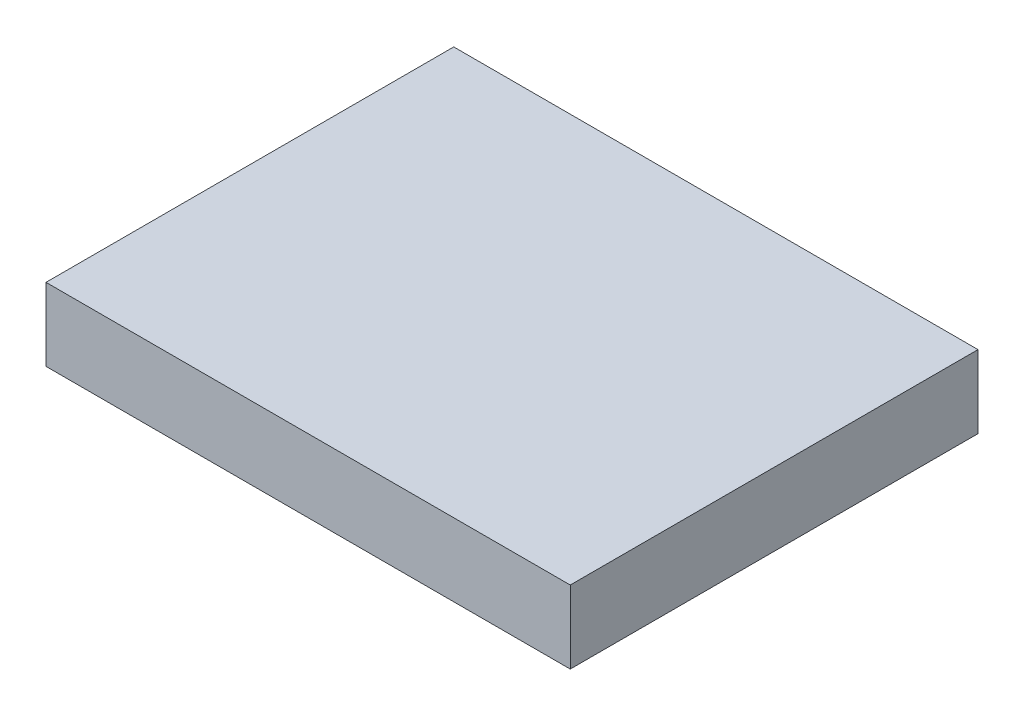
ISO-10303-21;
HEADER;
FILE_DESCRIPTION(('STEP AP214'),'2;1');
FILE_NAME('part.step','',(''),(''),'','','');
FILE_SCHEMA(('AUTOMOTIVE_DESIGN { 1 0 10303 214 1 1 1 1 }'));
ENDSEC;
DATA;
#1=APPLICATION_CONTEXT('core data for automotive mechanical design processes');
#2=APPLICATION_PROTOCOL_DEFINITION('international standard','automotive_design',2000,#1);
#3=PRODUCT_CONTEXT('',#1,'mechanical');
#4=PRODUCT('Part','Part','',(#3));
#5=PRODUCT_RELATED_PRODUCT_CATEGORY('part','',(#4));
#6=PRODUCT_DEFINITION_FORMATION('','',#4);
#7=PRODUCT_DEFINITION_CONTEXT('part definition',#1,'design');
#8=PRODUCT_DEFINITION('design','',#6,#7);
#9=PRODUCT_DEFINITION_SHAPE('','',#8);
#10=(LENGTH_UNIT() NAMED_UNIT(*) SI_UNIT(.MILLI.,.METRE.));
#11=(NAMED_UNIT(*) PLANE_ANGLE_UNIT() SI_UNIT($,.RADIAN.));
#12=(NAMED_UNIT(*) SI_UNIT($,.STERADIAN.) SOLID_ANGLE_UNIT());
#13=UNCERTAINTY_MEASURE_WITH_UNIT(LENGTH_MEASURE(1.E-05),#10,'distance_accuracy_value','');
#14=(GEOMETRIC_REPRESENTATION_CONTEXT(3) GLOBAL_UNCERTAINTY_ASSIGNED_CONTEXT((#13)) GLOBAL_UNIT_ASSIGNED_CONTEXT((#10,
#11,#12)) REPRESENTATION_CONTEXT('',''));
#15=CARTESIAN_POINT('',(0.,0.,0.));
#16=DIRECTION('',(0.,0.,1.));
#17=DIRECTION('',(1.,0.,0.));
#18=AXIS2_PLACEMENT_3D('',#15,#16,#17);
#19=CARTESIAN_POINT('',(0.,3.,0.));
#20=DIRECTION('',(1.,0.,0.));
#21=DIRECTION('',(0.,0.,-1.));
#22=AXIS2_PLACEMENT_3D('',#19,#20,#21);
#23=PLANE('',#22);
#24=DIRECTION('',(0.,0.,1.));
#25=VECTOR('',#24,1.);
#26=CARTESIAN_POINT('',(0.,0.,0.));
#27=LINE('',#26,#25);
#28=CARTESIAN_POINT('',(0.,0.,0.));
#29=VERTEX_POINT('',#28);
#30=CARTESIAN_POINT('',(0.,0.,16.8));
#31=VERTEX_POINT('',#30);
#32=EDGE_CURVE('E96',#29,#31,#27,.T.);
#33=ORIENTED_EDGE('',*,*,#32,.T.);
#34=DIRECTION('',(0.,-1.,0.));
#35=VECTOR('',#34,1.);
#36=CARTESIAN_POINT('',(0.,3.,16.8));
#37=LINE('',#36,#35);
#38=CARTESIAN_POINT('',(0.,3.,16.8));
#39=VERTEX_POINT('',#38);
#40=EDGE_CURVE('E11',#39,#31,#37,.T.);
#41=ORIENTED_EDGE('',*,*,#40,.F.);
#42=DIRECTION('',(0.,0.,1.));
#43=VECTOR('',#42,1.);
#44=CARTESIAN_POINT('',(0.,3.,0.));
#45=LINE('',#44,#43);
#46=CARTESIAN_POINT('',(0.,3.,0.));
#47=VERTEX_POINT('',#46);
#48=EDGE_CURVE('E84',#47,#39,#45,.T.);
#49=ORIENTED_EDGE('',*,*,#48,.F.);
#50=DIRECTION('',(0.,-1.,0.));
#51=VECTOR('',#50,1.);
#52=CARTESIAN_POINT('',(0.,3.,0.));
#53=LINE('',#52,#51);
#54=EDGE_CURVE('E92',#47,#29,#53,.T.);
#55=ORIENTED_EDGE('',*,*,#54,.T.);
#56=EDGE_LOOP('',(#33,#41,#49,#55));
#57=FACE_BOUND('',#56,.T.);
#58=ADVANCED_FACE('F33',(#57),#23,.F.);
#59=CARTESIAN_POINT('',(0.,3.,16.8));
#60=DIRECTION('',(0.,0.,-1.));
#61=DIRECTION('',(-1.,0.,0.));
#62=AXIS2_PLACEMENT_3D('',#59,#60,#61);
#63=PLANE('',#62);
#64=DIRECTION('',(1.,0.,0.));
#65=VECTOR('',#64,1.);
#66=CARTESIAN_POINT('',(0.,0.,16.8));
#67=LINE('',#66,#65);
#68=CARTESIAN_POINT('',(21.6,0.,16.8));
#69=VERTEX_POINT('',#68);
#70=EDGE_CURVE('E88',#31,#69,#67,.T.);
#71=ORIENTED_EDGE('',*,*,#70,.T.);
#72=DIRECTION('',(0.,-1.,0.));
#73=VECTOR('',#72,1.);
#74=CARTESIAN_POINT('',(21.6,3.,16.8));
#75=LINE('',#74,#73);
#76=CARTESIAN_POINT('',(21.6,3.,16.8));
#77=VERTEX_POINT('',#76);
#78=EDGE_CURVE('E41',#77,#69,#75,.T.);
#79=ORIENTED_EDGE('',*,*,#78,.F.);
#80=DIRECTION('',(1.,0.,0.));
#81=VECTOR('',#80,1.);
#82=CARTESIAN_POINT('',(0.,3.,16.8));
#83=LINE('',#82,#81);
#84=EDGE_CURVE('E79',#39,#77,#83,.T.);
#85=ORIENTED_EDGE('',*,*,#84,.F.);
#86=ORIENTED_EDGE('',*,*,#40,.T.);
#87=EDGE_LOOP('',(#71,#79,#85,#86));
#88=FACE_BOUND('',#87,.T.);
#89=ADVANCED_FACE('F87',(#88),#63,.F.);
#90=CARTESIAN_POINT('',(21.6,3.,0.));
#91=DIRECTION('',(-1.,0.,0.));
#92=DIRECTION('',(0.,0.,1.));
#93=AXIS2_PLACEMENT_3D('',#90,#91,#92);
#94=PLANE('',#93);
#95=DIRECTION('',(0.,0.,-1.));
#96=VECTOR('',#95,1.);
#97=CARTESIAN_POINT('',(21.6,0.,0.));
#98=LINE('',#97,#96);
#99=CARTESIAN_POINT('',(21.6,0.,0.));
#100=VERTEX_POINT('',#99);
#101=EDGE_CURVE('E66',#69,#100,#98,.T.);
#102=ORIENTED_EDGE('',*,*,#101,.T.);
#103=DIRECTION('',(0.,-1.,0.));
#104=VECTOR('',#103,1.);
#105=CARTESIAN_POINT('',(21.6,3.,0.));
#106=LINE('',#105,#104);
#107=CARTESIAN_POINT('',(21.6,3.,0.));
#108=VERTEX_POINT('',#107);
#109=EDGE_CURVE('E89',#108,#100,#106,.T.);
#110=ORIENTED_EDGE('',*,*,#109,.F.);
#111=DIRECTION('',(0.,0.,-1.));
#112=VECTOR('',#111,1.);
#113=CARTESIAN_POINT('',(21.6,3.,0.));
#114=LINE('',#113,#112);
#115=EDGE_CURVE('E82',#77,#108,#114,.T.);
#116=ORIENTED_EDGE('',*,*,#115,.F.);
#117=ORIENTED_EDGE('',*,*,#78,.T.);
#118=EDGE_LOOP('',(#102,#110,#116,#117));
#119=FACE_BOUND('',#118,.T.);
#120=ADVANCED_FACE('F90',(#119),#94,.F.);
#121=CARTESIAN_POINT('',(0.,3.,0.));
#122=DIRECTION('',(0.,0.,1.));
#123=DIRECTION('',(1.,0.,0.));
#124=AXIS2_PLACEMENT_3D('',#121,#122,#123);
#125=PLANE('',#124);
#126=DIRECTION('',(-1.,0.,0.));
#127=VECTOR('',#126,1.);
#128=CARTESIAN_POINT('',(0.,0.,0.));
#129=LINE('',#128,#127);
#130=EDGE_CURVE('E72',#100,#29,#129,.T.);
#131=ORIENTED_EDGE('',*,*,#130,.T.);
#132=ORIENTED_EDGE('',*,*,#54,.F.);
#133=DIRECTION('',(-1.,0.,0.));
#134=VECTOR('',#133,1.);
#135=CARTESIAN_POINT('',(0.,3.,0.));
#136=LINE('',#135,#134);
#137=EDGE_CURVE('E49',#108,#47,#136,.T.);
#138=ORIENTED_EDGE('',*,*,#137,.F.);
#139=ORIENTED_EDGE('',*,*,#109,.T.);
#140=EDGE_LOOP('',(#131,#132,#138,#139));
#141=FACE_BOUND('',#140,.T.);
#142=ADVANCED_FACE('F103',(#141),#125,.F.);
#143=CARTESIAN_POINT('',(0.,3.,0.));
#144=DIRECTION('',(0.,1.,0.));
#145=DIRECTION('',(0.,0.,1.));
#146=AXIS2_PLACEMENT_3D('',#143,#144,#145);
#147=PLANE('',#146);
#148=ORIENTED_EDGE('',*,*,#48,.T.);
#149=ORIENTED_EDGE('',*,*,#84,.T.);
#150=ORIENTED_EDGE('',*,*,#115,.T.);
#151=ORIENTED_EDGE('',*,*,#137,.T.);
#152=EDGE_LOOP('',(#148,#149,#150,#151));
#153=FACE_BOUND('',#152,.T.);
#154=ADVANCED_FACE('F80',(#153),#147,.T.);
#155=CARTESIAN_POINT('',(0.,0.,0.));
#156=DIRECTION('',(0.,1.,0.));
#157=DIRECTION('',(0.,0.,1.));
#158=AXIS2_PLACEMENT_3D('',#155,#156,#157);
#159=PLANE('',#158);
#160=ORIENTED_EDGE('',*,*,#32,.F.);
#161=ORIENTED_EDGE('',*,*,#130,.F.);
#162=ORIENTED_EDGE('',*,*,#101,.F.);
#163=ORIENTED_EDGE('',*,*,#70,.F.);
#164=EDGE_LOOP('',(#160,#161,#162,#163));
#165=FACE_BOUND('',#164,.T.);
#166=ADVANCED_FACE('F106',(#165),#159,.F.);
#167=CLOSED_SHELL('',(#58,#89,#120,#142,#154,#166));
#168=MANIFOLD_SOLID_BREP('B2',#167);
#169=ADVANCED_BREP_SHAPE_REPRESENTATION('',(#18,#168),#14);
#170=SHAPE_DEFINITION_REPRESENTATION(#9,#169);
ENDSEC;
END-ISO-10303-21;
